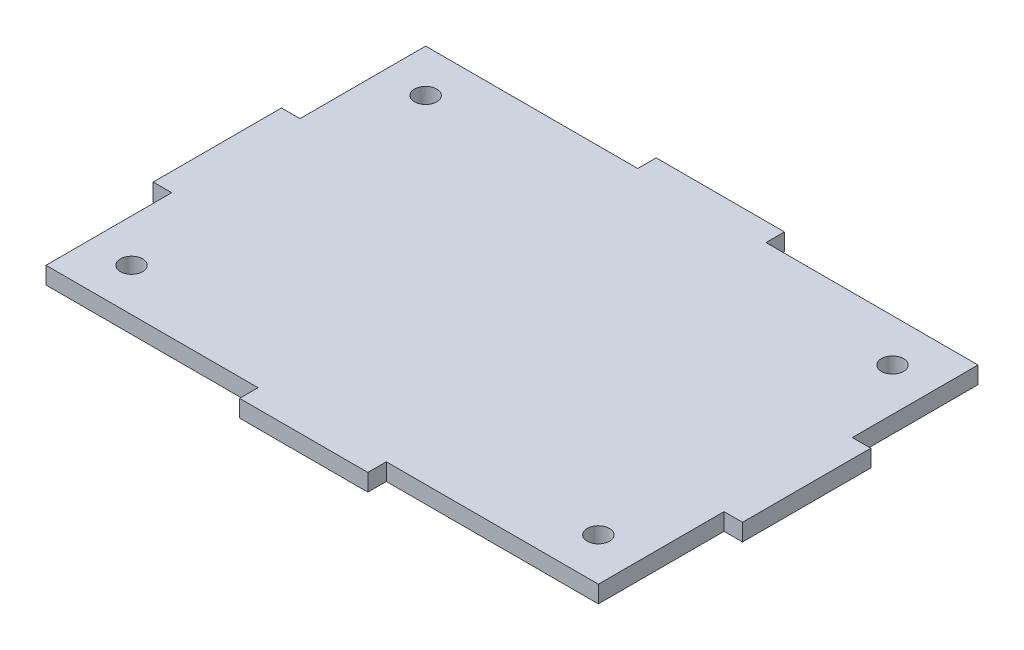
ISO-10303-21;
HEADER;
FILE_DESCRIPTION(('STEP AP214'),'2;1');
FILE_NAME('part.step','',(''),(''),'','','');
FILE_SCHEMA(('AUTOMOTIVE_DESIGN { 1 0 10303 214 1 1 1 1 }'));
ENDSEC;
DATA;
#1=APPLICATION_CONTEXT('core data for automotive mechanical design processes');
#2=APPLICATION_PROTOCOL_DEFINITION('international standard','automotive_design',2000,#1);
#3=PRODUCT_CONTEXT('',#1,'mechanical');
#4=PRODUCT('Part','Part','',(#3));
#5=PRODUCT_RELATED_PRODUCT_CATEGORY('part','',(#4));
#6=PRODUCT_DEFINITION_FORMATION('','',#4);
#7=PRODUCT_DEFINITION_CONTEXT('part definition',#1,'design');
#8=PRODUCT_DEFINITION('design','',#6,#7);
#9=PRODUCT_DEFINITION_SHAPE('','',#8);
#10=(LENGTH_UNIT() NAMED_UNIT(*) SI_UNIT(.MILLI.,.METRE.));
#11=(NAMED_UNIT(*) PLANE_ANGLE_UNIT() SI_UNIT($,.RADIAN.));
#12=(NAMED_UNIT(*) SI_UNIT($,.STERADIAN.) SOLID_ANGLE_UNIT());
#13=UNCERTAINTY_MEASURE_WITH_UNIT(LENGTH_MEASURE(1.E-05),#10,'distance_accuracy_value','');
#14=(GEOMETRIC_REPRESENTATION_CONTEXT(3) GLOBAL_UNCERTAINTY_ASSIGNED_CONTEXT((#13)) GLOBAL_UNIT_ASSIGNED_CONTEXT((#10,
#11,#12)) REPRESENTATION_CONTEXT('',''));
#15=CARTESIAN_POINT('',(0.,0.,0.));
#16=DIRECTION('',(0.,0.,1.));
#17=DIRECTION('',(1.,0.,0.));
#18=AXIS2_PLACEMENT_3D('',#15,#16,#17);
#19=CARTESIAN_POINT('',(-41.021,2.54,28.194));
#20=DIRECTION('',(1.,0.,0.));
#21=DIRECTION('',(0.,0.,-1.));
#22=AXIS2_PLACEMENT_3D('',#19,#20,#21);
#23=PLANE('',#22);
#24=DIRECTION('',(0.,1.,0.));
#25=VECTOR('',#24,1.);
#26=CARTESIAN_POINT('',(-41.021,-19.2464969862051,9.525));
#27=LINE('',#26,#25);
#28=CARTESIAN_POINT('',(-41.021,0.,9.52500000000001));
#29=VERTEX_POINT('',#28);
#30=CARTESIAN_POINT('',(-41.021,2.54,9.525));
#31=VERTEX_POINT('',#30);
#32=EDGE_CURVE('E56',#29,#31,#27,.T.);
#33=ORIENTED_EDGE('',*,*,#32,.F.);
#34=DIRECTION('',(0.,0.,1.));
#35=VECTOR('',#34,1.);
#36=CARTESIAN_POINT('',(-41.021,0.,28.194));
#37=LINE('',#36,#35);
#38=CARTESIAN_POINT('',(-41.021,0.,28.194));
#39=VERTEX_POINT('',#38);
#40=EDGE_CURVE('E303',#29,#39,#37,.T.);
#41=ORIENTED_EDGE('',*,*,#40,.T.);
#42=DIRECTION('',(0.,-1.,0.));
#43=VECTOR('',#42,1.);
#44=CARTESIAN_POINT('',(-41.021,2.54,28.194));
#45=LINE('',#44,#43);
#46=CARTESIAN_POINT('',(-41.021,2.54,28.194));
#47=VERTEX_POINT('',#46);
#48=EDGE_CURVE('E11',#47,#39,#45,.T.);
#49=ORIENTED_EDGE('',*,*,#48,.F.);
#50=DIRECTION('',(0.,0.,1.));
#51=VECTOR('',#50,1.);
#52=CARTESIAN_POINT('',(-41.021,2.54,28.194));
#53=LINE('',#52,#51);
#54=EDGE_CURVE('E308',#31,#47,#53,.T.);
#55=ORIENTED_EDGE('',*,*,#54,.F.);
#56=EDGE_LOOP('',(#33,#41,#49,#55));
#57=FACE_BOUND('',#56,.T.);
#58=ADVANCED_FACE('F33',(#57),#23,.F.);
#59=CARTESIAN_POINT('',(41.021,2.54,28.194));
#60=DIRECTION('',(-1.,0.,0.));
#61=DIRECTION('',(0.,0.,1.));
#62=AXIS2_PLACEMENT_3D('',#59,#60,#61);
#63=PLANE('',#62);
#64=DIRECTION('',(0.,1.,0.));
#65=VECTOR('',#64,1.);
#66=CARTESIAN_POINT('',(41.021,-19.2464969862051,-9.525));
#67=LINE('',#66,#65);
#68=CARTESIAN_POINT('',(41.021,0.,-9.52499999999998));
#69=VERTEX_POINT('',#68);
#70=CARTESIAN_POINT('',(41.021,2.54,-9.525));
#71=VERTEX_POINT('',#70);
#72=EDGE_CURVE('E210',#69,#71,#67,.T.);
#73=ORIENTED_EDGE('',*,*,#72,.F.);
#74=DIRECTION('',(0.,0.,-1.));
#75=VECTOR('',#74,1.);
#76=CARTESIAN_POINT('',(41.021,0.,28.194));
#77=LINE('',#76,#75);
#78=CARTESIAN_POINT('',(41.021,0.,-28.194));
#79=VERTEX_POINT('',#78);
#80=EDGE_CURVE('E326',#69,#79,#77,.T.);
#81=ORIENTED_EDGE('',*,*,#80,.T.);
#82=DIRECTION('',(0.,-1.,0.));
#83=VECTOR('',#82,1.);
#84=CARTESIAN_POINT('',(41.021,2.54,-28.194));
#85=LINE('',#84,#83);
#86=CARTESIAN_POINT('',(41.021,2.54,-28.194));
#87=VERTEX_POINT('',#86);
#88=EDGE_CURVE('E334',#87,#79,#85,.T.);
#89=ORIENTED_EDGE('',*,*,#88,.F.);
#90=DIRECTION('',(0.,0.,-1.));
#91=VECTOR('',#90,1.);
#92=CARTESIAN_POINT('',(41.021,2.54,28.194));
#93=LINE('',#92,#91);
#94=EDGE_CURVE('E312',#71,#87,#93,.T.);
#95=ORIENTED_EDGE('',*,*,#94,.F.);
#96=EDGE_LOOP('',(#73,#81,#89,#95));
#97=FACE_BOUND('',#96,.T.);
#98=ADVANCED_FACE('F405',(#97),#63,.F.);
#99=CARTESIAN_POINT('',(41.021,2.54,28.194));
#100=DIRECTION('',(0.,0.,-1.));
#101=DIRECTION('',(-1.,0.,0.));
#102=AXIS2_PLACEMENT_3D('',#99,#100,#101);
#103=PLANE('',#102);
#104=DIRECTION('',(0.,1.,0.));
#105=VECTOR('',#104,1.);
#106=CARTESIAN_POINT('',(9.52500000000001,-19.2464969862051,28.194));
#107=LINE('',#106,#105);
#108=CARTESIAN_POINT('',(9.52500000000001,0.,28.194));
#109=VERTEX_POINT('',#108);
#110=CARTESIAN_POINT('',(9.52500000000001,2.54,28.194));
#111=VERTEX_POINT('',#110);
#112=EDGE_CURVE('E249',#109,#111,#107,.T.);
#113=ORIENTED_EDGE('',*,*,#112,.F.);
#114=DIRECTION('',(1.,0.,0.));
#115=VECTOR('',#114,1.);
#116=CARTESIAN_POINT('',(41.021,0.,28.194));
#117=LINE('',#116,#115);
#118=CARTESIAN_POINT('',(41.021,0.,28.194));
#119=VERTEX_POINT('',#118);
#120=EDGE_CURVE('E323',#109,#119,#117,.T.);
#121=ORIENTED_EDGE('',*,*,#120,.T.);
#122=DIRECTION('',(0.,-1.,0.));
#123=VECTOR('',#122,1.);
#124=CARTESIAN_POINT('',(41.021,2.54,28.194));
#125=LINE('',#124,#123);
#126=CARTESIAN_POINT('',(41.021,2.54,28.194));
#127=VERTEX_POINT('',#126);
#128=EDGE_CURVE('E41',#127,#119,#125,.T.);
#129=ORIENTED_EDGE('',*,*,#128,.F.);
#130=DIRECTION('',(1.,0.,0.));
#131=VECTOR('',#130,1.);
#132=CARTESIAN_POINT('',(41.021,2.54,28.194));
#133=LINE('',#132,#131);
#134=EDGE_CURVE('E307',#111,#127,#133,.T.);
#135=ORIENTED_EDGE('',*,*,#134,.F.);
#136=EDGE_LOOP('',(#113,#121,#129,#135));
#137=FACE_BOUND('',#136,.T.);
#138=ADVANCED_FACE('F357',(#137),#103,.F.);
#139=CARTESIAN_POINT('',(41.021,2.54,-28.194));
#140=DIRECTION('',(0.,0.,1.));
#141=DIRECTION('',(1.,0.,0.));
#142=AXIS2_PLACEMENT_3D('',#139,#140,#141);
#143=PLANE('',#142);
#144=DIRECTION('',(0.,1.,0.));
#145=VECTOR('',#144,1.);
#146=CARTESIAN_POINT('',(-9.525,-19.2464969862051,-28.194));
#147=LINE('',#146,#145);
#148=CARTESIAN_POINT('',(-9.525,0.,-28.194));
#149=VERTEX_POINT('',#148);
#150=CARTESIAN_POINT('',(-9.525,2.54,-28.194));
#151=VERTEX_POINT('',#150);
#152=EDGE_CURVE('E274',#149,#151,#147,.T.);
#153=ORIENTED_EDGE('',*,*,#152,.F.);
#154=DIRECTION('',(-1.,0.,0.));
#155=VECTOR('',#154,1.);
#156=CARTESIAN_POINT('',(41.021,0.,-28.194));
#157=LINE('',#156,#155);
#158=CARTESIAN_POINT('',(-41.021,0.,-28.194));
#159=VERTEX_POINT('',#158);
#160=EDGE_CURVE('E329',#149,#159,#157,.T.);
#161=ORIENTED_EDGE('',*,*,#160,.T.);
#162=DIRECTION('',(0.,-1.,0.));
#163=VECTOR('',#162,1.);
#164=CARTESIAN_POINT('',(-41.021,2.54,-28.194));
#165=LINE('',#164,#163);
#166=CARTESIAN_POINT('',(-41.021,2.54,-28.194));
#167=VERTEX_POINT('',#166);
#168=EDGE_CURVE('E320',#167,#159,#165,.T.);
#169=ORIENTED_EDGE('',*,*,#168,.F.);
#170=DIRECTION('',(-1.,0.,0.));
#171=VECTOR('',#170,1.);
#172=CARTESIAN_POINT('',(41.021,2.54,-28.194));
#173=LINE('',#172,#171);
#174=EDGE_CURVE('E316',#151,#167,#173,.T.);
#175=ORIENTED_EDGE('',*,*,#174,.F.);
#176=EDGE_LOOP('',(#153,#161,#169,#175));
#177=FACE_BOUND('',#176,.T.);
#178=ADVANCED_FACE('F383',(#177),#143,.F.);
#179=CARTESIAN_POINT('',(0.,2.54,0.));
#180=DIRECTION('',(0.,1.,0.));
#181=DIRECTION('',(0.,0.,1.));
#182=AXIS2_PLACEMENT_3D('',#179,#180,#181);
#183=PLANE('',#182);
#184=CARTESIAN_POINT('',(34.671,2.54,21.844));
#185=DIRECTION('',(0.,1.,0.));
#186=DIRECTION('',(0.,0.,1.));
#187=AXIS2_PLACEMENT_3D('',#184,#185,#186);
#188=CIRCLE('',#187,1.651);
#189=CARTESIAN_POINT('',(34.671,2.54,23.495));
#190=VERTEX_POINT('',#189);
#191=EDGE_CURVE('E288',#190,#190,#188,.T.);
#192=ORIENTED_EDGE('',*,*,#191,.F.);
#193=EDGE_LOOP('',(#192));
#194=FACE_BOUND('',#193,.T.);
#195=CARTESIAN_POINT('',(-34.671,2.54,-21.844));
#196=DIRECTION('',(0.,1.,0.));
#197=DIRECTION('',(0.,0.,1.));
#198=AXIS2_PLACEMENT_3D('',#195,#196,#197);
#199=CIRCLE('',#198,1.651);
#200=CARTESIAN_POINT('',(-34.671,2.54,-20.193));
#201=VERTEX_POINT('',#200);
#202=EDGE_CURVE('E300',#201,#201,#199,.T.);
#203=ORIENTED_EDGE('',*,*,#202,.F.);
#204=EDGE_LOOP('',(#203));
#205=FACE_BOUND('',#204,.T.);
#206=CARTESIAN_POINT('',(-41.021,2.54,-9.52499999999999));
#207=VERTEX_POINT('',#206);
#208=EDGE_CURVE('E194',#167,#207,#53,.T.);
#209=ORIENTED_EDGE('',*,*,#208,.T.);
#210=DIRECTION('',(-1.,0.,0.));
#211=VECTOR('',#210,1.);
#212=CARTESIAN_POINT('',(-41.021,2.54,-9.525));
#213=LINE('',#212,#211);
#214=CARTESIAN_POINT('',(-43.7642,2.54,-9.525));
#215=VERTEX_POINT('',#214);
#216=EDGE_CURVE('E176',#207,#215,#213,.T.);
#217=ORIENTED_EDGE('',*,*,#216,.T.);
#218=DIRECTION('',(0.,0.,1.));
#219=VECTOR('',#218,1.);
#220=CARTESIAN_POINT('',(-43.7642,2.54,-9.525));
#221=LINE('',#220,#219);
#222=CARTESIAN_POINT('',(-43.7642,2.54,9.525));
#223=VERTEX_POINT('',#222);
#224=EDGE_CURVE('E184',#215,#223,#221,.T.);
#225=ORIENTED_EDGE('',*,*,#224,.T.);
#226=DIRECTION('',(1.,0.,0.));
#227=VECTOR('',#226,1.);
#228=CARTESIAN_POINT('',(-41.021,2.54,9.525));
#229=LINE('',#228,#227);
#230=EDGE_CURVE('E190',#223,#31,#229,.T.);
#231=ORIENTED_EDGE('',*,*,#230,.T.);
#232=ORIENTED_EDGE('',*,*,#54,.T.);
#233=CARTESIAN_POINT('',(-9.525,2.54,28.194));
#234=VERTEX_POINT('',#233);
#235=EDGE_CURVE('E309',#47,#234,#133,.T.);
#236=ORIENTED_EDGE('',*,*,#235,.T.);
#237=DIRECTION('',(0.,0.,1.));
#238=VECTOR('',#237,1.);
#239=CARTESIAN_POINT('',(-9.525,2.54,28.194));
#240=LINE('',#239,#238);
#241=CARTESIAN_POINT('',(-9.525,2.54,30.9372));
#242=VERTEX_POINT('',#241);
#243=EDGE_CURVE('E231',#234,#242,#240,.T.);
#244=ORIENTED_EDGE('',*,*,#243,.T.);
#245=DIRECTION('',(1.,0.,0.));
#246=VECTOR('',#245,1.);
#247=CARTESIAN_POINT('',(-9.525,2.54,30.9372));
#248=LINE('',#247,#246);
#249=CARTESIAN_POINT('',(9.525,2.54,30.9372));
#250=VERTEX_POINT('',#249);
#251=EDGE_CURVE('E241',#242,#250,#248,.T.);
#252=ORIENTED_EDGE('',*,*,#251,.T.);
#253=DIRECTION('',(0.,0.,-1.));
#254=VECTOR('',#253,1.);
#255=CARTESIAN_POINT('',(9.52500000000001,2.54,28.194));
#256=LINE('',#255,#254);
#257=EDGE_CURVE('E244',#250,#111,#256,.T.);
#258=ORIENTED_EDGE('',*,*,#257,.T.);
#259=ORIENTED_EDGE('',*,*,#134,.T.);
#260=CARTESIAN_POINT('',(41.021,2.54,9.52500000000001));
#261=VERTEX_POINT('',#260);
#262=EDGE_CURVE('E313',#127,#261,#93,.T.);
#263=ORIENTED_EDGE('',*,*,#262,.T.);
#264=DIRECTION('',(1.,0.,0.));
#265=VECTOR('',#264,1.);
#266=CARTESIAN_POINT('',(41.021,2.54,9.525));
#267=LINE('',#266,#265);
#268=CARTESIAN_POINT('',(43.7642,2.54,9.525));
#269=VERTEX_POINT('',#268);
#270=EDGE_CURVE('E206',#261,#269,#267,.T.);
#271=ORIENTED_EDGE('',*,*,#270,.T.);
#272=DIRECTION('',(0.,0.,-1.));
#273=VECTOR('',#272,1.);
#274=CARTESIAN_POINT('',(43.7642,2.54,-9.525));
#275=LINE('',#274,#273);
#276=CARTESIAN_POINT('',(43.7642,2.54,-9.525));
#277=VERTEX_POINT('',#276);
#278=EDGE_CURVE('E215',#269,#277,#275,.T.);
#279=ORIENTED_EDGE('',*,*,#278,.T.);
#280=DIRECTION('',(-1.,0.,0.));
#281=VECTOR('',#280,1.);
#282=CARTESIAN_POINT('',(41.021,2.54,-9.525));
#283=LINE('',#282,#281);
#284=EDGE_CURVE('E218',#277,#71,#283,.T.);
#285=ORIENTED_EDGE('',*,*,#284,.T.);
#286=ORIENTED_EDGE('',*,*,#94,.T.);
#287=CARTESIAN_POINT('',(9.525,2.54,-28.194));
#288=VERTEX_POINT('',#287);
#289=EDGE_CURVE('E317',#87,#288,#173,.T.);
#290=ORIENTED_EDGE('',*,*,#289,.T.);
#291=DIRECTION('',(0.,0.,-1.));
#292=VECTOR('',#291,1.);
#293=CARTESIAN_POINT('',(9.525,2.54,-28.194));
#294=LINE('',#293,#292);
#295=CARTESIAN_POINT('',(9.525,2.54,-30.9372));
#296=VERTEX_POINT('',#295);
#297=EDGE_CURVE('E256',#288,#296,#294,.T.);
#298=ORIENTED_EDGE('',*,*,#297,.T.);
#299=DIRECTION('',(-1.,0.,0.));
#300=VECTOR('',#299,1.);
#301=CARTESIAN_POINT('',(9.525,2.54,-30.9372));
#302=LINE('',#301,#300);
#303=CARTESIAN_POINT('',(-9.525,2.54,-30.9372));
#304=VERTEX_POINT('',#303);
#305=EDGE_CURVE('E266',#296,#304,#302,.T.);
#306=ORIENTED_EDGE('',*,*,#305,.T.);
#307=DIRECTION('',(0.,0.,1.));
#308=VECTOR('',#307,1.);
#309=CARTESIAN_POINT('',(-9.525,2.54,-28.194));
#310=LINE('',#309,#308);
#311=EDGE_CURVE('E269',#304,#151,#310,.T.);
#312=ORIENTED_EDGE('',*,*,#311,.T.);
#313=ORIENTED_EDGE('',*,*,#174,.T.);
#314=EDGE_LOOP('',(#209,#217,#225,#231,#232,#236,#244,#252,#258,#259,#263,#271,#279,#285,#286,
#290,#298,#306,#312,#313));
#315=FACE_BOUND('',#314,.T.);
#316=CARTESIAN_POINT('',(-34.671,2.54,21.844));
#317=DIRECTION('',(0.,1.,0.));
#318=DIRECTION('',(0.,0.,1.));
#319=AXIS2_PLACEMENT_3D('',#316,#317,#318);
#320=CIRCLE('',#319,1.651);
#321=CARTESIAN_POINT('',(-34.671,2.54,23.495));
#322=VERTEX_POINT('',#321);
#323=EDGE_CURVE('E294',#322,#322,#320,.T.);
#324=ORIENTED_EDGE('',*,*,#323,.F.);
#325=EDGE_LOOP('',(#324));
#326=FACE_BOUND('',#325,.T.);
#327=CARTESIAN_POINT('',(34.671,2.54,-21.844));
#328=DIRECTION('',(0.,1.,0.));
#329=DIRECTION('',(0.,0.,1.));
#330=AXIS2_PLACEMENT_3D('',#327,#328,#329);
#331=CIRCLE('',#330,1.651);
#332=CARTESIAN_POINT('',(34.671,2.54,-20.193));
#333=VERTEX_POINT('',#332);
#334=EDGE_CURVE('E282',#333,#333,#331,.T.);
#335=ORIENTED_EDGE('',*,*,#334,.F.);
#336=EDGE_LOOP('',(#335));
#337=FACE_BOUND('',#336,.T.);
#338=ADVANCED_FACE('F192',(#194,#205,#315,#326,#337),#183,.T.);
#339=CARTESIAN_POINT('',(0.,0.,0.));
#340=DIRECTION('',(0.,1.,0.));
#341=DIRECTION('',(0.,0.,1.));
#342=AXIS2_PLACEMENT_3D('',#339,#340,#341);
#343=PLANE('',#342);
#344=CARTESIAN_POINT('',(-41.021,0.,-9.52499999999999));
#345=VERTEX_POINT('',#344);
#346=EDGE_CURVE('E321',#159,#345,#37,.T.);
#347=ORIENTED_EDGE('',*,*,#346,.F.);
#348=ORIENTED_EDGE('',*,*,#160,.F.);
#349=DIRECTION('',(0.,0.,-1.));
#350=VECTOR('',#349,1.);
#351=CARTESIAN_POINT('',(-9.525,0.,-28.194));
#352=LINE('',#351,#350);
#353=CARTESIAN_POINT('',(-9.525,0.,-30.9372));
#354=VERTEX_POINT('',#353);
#355=EDGE_CURVE('E257',#149,#354,#352,.T.);
#356=ORIENTED_EDGE('',*,*,#355,.T.);
#357=DIRECTION('',(1.,0.,0.));
#358=VECTOR('',#357,1.);
#359=CARTESIAN_POINT('',(9.525,0.,-30.9372));
#360=LINE('',#359,#358);
#361=CARTESIAN_POINT('',(9.525,0.,-30.9372));
#362=VERTEX_POINT('',#361);
#363=EDGE_CURVE('E263',#354,#362,#360,.T.);
#364=ORIENTED_EDGE('',*,*,#363,.T.);
#365=DIRECTION('',(0.,0.,1.));
#366=VECTOR('',#365,1.);
#367=CARTESIAN_POINT('',(9.525,0.,-28.194));
#368=LINE('',#367,#366);
#369=CARTESIAN_POINT('',(9.525,0.,-28.194));
#370=VERTEX_POINT('',#369);
#371=EDGE_CURVE('E259',#362,#370,#368,.T.);
#372=ORIENTED_EDGE('',*,*,#371,.T.);
#373=EDGE_CURVE('E330',#79,#370,#157,.T.);
#374=ORIENTED_EDGE('',*,*,#373,.F.);
#375=ORIENTED_EDGE('',*,*,#80,.F.);
#376=DIRECTION('',(1.,0.,0.));
#377=VECTOR('',#376,1.);
#378=CARTESIAN_POINT('',(41.021,0.,-9.525));
#379=LINE('',#378,#377);
#380=CARTESIAN_POINT('',(43.7642,0.,-9.525));
#381=VERTEX_POINT('',#380);
#382=EDGE_CURVE('E209',#69,#381,#379,.T.);
#383=ORIENTED_EDGE('',*,*,#382,.T.);
#384=DIRECTION('',(0.,0.,1.));
#385=VECTOR('',#384,1.);
#386=CARTESIAN_POINT('',(43.7642,0.,-9.525));
#387=LINE('',#386,#385);
#388=CARTESIAN_POINT('',(43.7642,0.,9.525));
#389=VERTEX_POINT('',#388);
#390=EDGE_CURVE('E207',#381,#389,#387,.T.);
#391=ORIENTED_EDGE('',*,*,#390,.T.);
#392=DIRECTION('',(-1.,0.,0.));
#393=VECTOR('',#392,1.);
#394=CARTESIAN_POINT('',(41.021,0.,9.525));
#395=LINE('',#394,#393);
#396=CARTESIAN_POINT('',(41.021,0.,9.52500000000001));
#397=VERTEX_POINT('',#396);
#398=EDGE_CURVE('E212',#389,#397,#395,.T.);
#399=ORIENTED_EDGE('',*,*,#398,.T.);
#400=EDGE_CURVE('E327',#119,#397,#77,.T.);
#401=ORIENTED_EDGE('',*,*,#400,.F.);
#402=ORIENTED_EDGE('',*,*,#120,.F.);
#403=DIRECTION('',(0.,0.,1.));
#404=VECTOR('',#403,1.);
#405=CARTESIAN_POINT('',(9.52500000000001,0.,28.194));
#406=LINE('',#405,#404);
#407=CARTESIAN_POINT('',(9.525,0.,30.9372));
#408=VERTEX_POINT('',#407);
#409=EDGE_CURVE('E232',#109,#408,#406,.T.);
#410=ORIENTED_EDGE('',*,*,#409,.T.);
#411=DIRECTION('',(-1.,0.,0.));
#412=VECTOR('',#411,1.);
#413=CARTESIAN_POINT('',(-9.525,0.,30.9372));
#414=LINE('',#413,#412);
#415=CARTESIAN_POINT('',(-9.525,0.,30.9372));
#416=VERTEX_POINT('',#415);
#417=EDGE_CURVE('E238',#408,#416,#414,.T.);
#418=ORIENTED_EDGE('',*,*,#417,.T.);
#419=DIRECTION('',(0.,0.,-1.));
#420=VECTOR('',#419,1.);
#421=CARTESIAN_POINT('',(-9.525,0.,28.194));
#422=LINE('',#421,#420);
#423=CARTESIAN_POINT('',(-9.525,0.,28.194));
#424=VERTEX_POINT('',#423);
#425=EDGE_CURVE('E234',#416,#424,#422,.T.);
#426=ORIENTED_EDGE('',*,*,#425,.T.);
#427=EDGE_CURVE('E324',#39,#424,#117,.T.);
#428=ORIENTED_EDGE('',*,*,#427,.F.);
#429=ORIENTED_EDGE('',*,*,#40,.F.);
#430=DIRECTION('',(-1.,0.,0.));
#431=VECTOR('',#430,1.);
#432=CARTESIAN_POINT('',(-41.021,0.,9.525));
#433=LINE('',#432,#431);
#434=CARTESIAN_POINT('',(-43.7642,0.,9.525));
#435=VERTEX_POINT('',#434);
#436=EDGE_CURVE('E197',#29,#435,#433,.T.);
#437=ORIENTED_EDGE('',*,*,#436,.T.);
#438=DIRECTION('',(0.,0.,-1.));
#439=VECTOR('',#438,1.);
#440=CARTESIAN_POINT('',(-43.7642,0.,-9.525));
#441=LINE('',#440,#439);
#442=CARTESIAN_POINT('',(-43.7642,0.,-9.525));
#443=VERTEX_POINT('',#442);
#444=EDGE_CURVE('E202',#435,#443,#441,.T.);
#445=ORIENTED_EDGE('',*,*,#444,.T.);
#446=DIRECTION('',(1.,0.,0.));
#447=VECTOR('',#446,1.);
#448=CARTESIAN_POINT('',(-41.021,0.,-9.525));
#449=LINE('',#448,#447);
#450=EDGE_CURVE('E178',#443,#345,#449,.T.);
#451=ORIENTED_EDGE('',*,*,#450,.T.);
#452=EDGE_LOOP('',(#347,#348,#356,#364,#372,#374,#375,#383,#391,#399,#401,#402,#410,#418,#426,
#428,#429,#437,#445,#451));
#453=FACE_BOUND('',#452,.T.);
#454=CARTESIAN_POINT('',(-34.671,0.,-21.844));
#455=DIRECTION('',(0.,1.,0.));
#456=DIRECTION('',(0.,0.,1.));
#457=AXIS2_PLACEMENT_3D('',#454,#455,#456);
#458=CIRCLE('',#457,1.651);
#459=CARTESIAN_POINT('',(-34.671,0.,-20.193));
#460=VERTEX_POINT('',#459);
#461=EDGE_CURVE('E297',#460,#460,#458,.T.);
#462=ORIENTED_EDGE('',*,*,#461,.T.);
#463=EDGE_LOOP('',(#462));
#464=FACE_BOUND('',#463,.T.);
#465=CARTESIAN_POINT('',(-34.671,0.,21.844));
#466=DIRECTION('',(0.,1.,0.));
#467=DIRECTION('',(0.,0.,1.));
#468=AXIS2_PLACEMENT_3D('',#465,#466,#467);
#469=CIRCLE('',#468,1.651);
#470=CARTESIAN_POINT('',(-34.671,0.,23.495));
#471=VERTEX_POINT('',#470);
#472=EDGE_CURVE('E291',#471,#471,#469,.T.);
#473=ORIENTED_EDGE('',*,*,#472,.T.);
#474=EDGE_LOOP('',(#473));
#475=FACE_BOUND('',#474,.T.);
#476=CARTESIAN_POINT('',(34.671,0.,21.844));
#477=DIRECTION('',(0.,1.,0.));
#478=DIRECTION('',(0.,0.,1.));
#479=AXIS2_PLACEMENT_3D('',#476,#477,#478);
#480=CIRCLE('',#479,1.651);
#481=CARTESIAN_POINT('',(34.671,0.,23.495));
#482=VERTEX_POINT('',#481);
#483=EDGE_CURVE('E285',#482,#482,#480,.T.);
#484=ORIENTED_EDGE('',*,*,#483,.T.);
#485=EDGE_LOOP('',(#484));
#486=FACE_BOUND('',#485,.T.);
#487=CARTESIAN_POINT('',(34.671,0.,-21.844));
#488=DIRECTION('',(0.,1.,0.));
#489=DIRECTION('',(0.,0.,1.));
#490=AXIS2_PLACEMENT_3D('',#487,#488,#489);
#491=CIRCLE('',#490,1.651);
#492=CARTESIAN_POINT('',(34.671,0.,-20.193));
#493=VERTEX_POINT('',#492);
#494=EDGE_CURVE('E281',#493,#493,#491,.T.);
#495=ORIENTED_EDGE('',*,*,#494,.T.);
#496=EDGE_LOOP('',(#495));
#497=FACE_BOUND('',#496,.T.);
#498=ADVANCED_FACE('F346',(#453,#464,#475,#486,#497),#343,.F.);
#499=ORIENTED_EDGE('',*,*,#346,.T.);
#500=DIRECTION('',(0.,1.,0.));
#501=VECTOR('',#500,1.);
#502=CARTESIAN_POINT('',(-41.021,-19.2464969862051,-9.525));
#503=LINE('',#502,#501);
#504=EDGE_CURVE('E48',#345,#207,#503,.T.);
#505=ORIENTED_EDGE('',*,*,#504,.T.);
#506=ORIENTED_EDGE('',*,*,#208,.F.);
#507=ORIENTED_EDGE('',*,*,#168,.T.);
#508=EDGE_LOOP('',(#499,#505,#506,#507));
#509=FACE_BOUND('',#508,.T.);
#510=ADVANCED_FACE('F35',(#509),#23,.F.);
#511=ORIENTED_EDGE('',*,*,#427,.T.);
#512=DIRECTION('',(0.,1.,0.));
#513=VECTOR('',#512,1.);
#514=CARTESIAN_POINT('',(-9.525,-19.2464969862051,28.194));
#515=LINE('',#514,#513);
#516=EDGE_CURVE('E235',#424,#234,#515,.T.);
#517=ORIENTED_EDGE('',*,*,#516,.T.);
#518=ORIENTED_EDGE('',*,*,#235,.F.);
#519=ORIENTED_EDGE('',*,*,#48,.T.);
#520=EDGE_LOOP('',(#511,#517,#518,#519));
#521=FACE_BOUND('',#520,.T.);
#522=ADVANCED_FACE('F375',(#521),#103,.F.);
#523=ORIENTED_EDGE('',*,*,#400,.T.);
#524=DIRECTION('',(0.,1.,0.));
#525=VECTOR('',#524,1.);
#526=CARTESIAN_POINT('',(41.021,-19.2464969862051,9.525));
#527=LINE('',#526,#525);
#528=EDGE_CURVE('E221',#397,#261,#527,.T.);
#529=ORIENTED_EDGE('',*,*,#528,.T.);
#530=ORIENTED_EDGE('',*,*,#262,.F.);
#531=ORIENTED_EDGE('',*,*,#128,.T.);
#532=EDGE_LOOP('',(#523,#529,#530,#531));
#533=FACE_BOUND('',#532,.T.);
#534=ADVANCED_FACE('F341',(#533),#63,.F.);
#535=ORIENTED_EDGE('',*,*,#373,.T.);
#536=DIRECTION('',(0.,1.,0.));
#537=VECTOR('',#536,1.);
#538=CARTESIAN_POINT('',(9.525,-19.2464969862051,-28.194));
#539=LINE('',#538,#537);
#540=EDGE_CURVE('E260',#370,#288,#539,.T.);
#541=ORIENTED_EDGE('',*,*,#540,.T.);
#542=ORIENTED_EDGE('',*,*,#289,.F.);
#543=ORIENTED_EDGE('',*,*,#88,.T.);
#544=EDGE_LOOP('',(#535,#541,#542,#543));
#545=FACE_BOUND('',#544,.T.);
#546=ADVANCED_FACE('F401',(#545),#143,.F.);
#547=CARTESIAN_POINT('',(-34.671,2.54,-21.844));
#548=DIRECTION('',(0.,-1.,0.));
#549=DIRECTION('',(0.,0.,-1.));
#550=AXIS2_PLACEMENT_3D('',#547,#548,#549);
#551=CYLINDRICAL_SURFACE('',#550,1.651);
#552=ORIENTED_EDGE('',*,*,#202,.T.);
#553=EDGE_LOOP('',(#552));
#554=FACE_BOUND('',#553,.T.);
#555=ORIENTED_EDGE('',*,*,#461,.F.);
#556=EDGE_LOOP('',(#555));
#557=FACE_BOUND('',#556,.T.);
#558=ADVANCED_FACE('F441',(#554,#557),#551,.F.);
#559=CARTESIAN_POINT('',(-34.671,2.54,21.844));
#560=DIRECTION('',(0.,-1.,0.));
#561=DIRECTION('',(0.,0.,-1.));
#562=AXIS2_PLACEMENT_3D('',#559,#560,#561);
#563=CYLINDRICAL_SURFACE('',#562,1.651);
#564=ORIENTED_EDGE('',*,*,#323,.T.);
#565=EDGE_LOOP('',(#564));
#566=FACE_BOUND('',#565,.T.);
#567=ORIENTED_EDGE('',*,*,#472,.F.);
#568=EDGE_LOOP('',(#567));
#569=FACE_BOUND('',#568,.T.);
#570=ADVANCED_FACE('F458',(#566,#569),#563,.F.);
#571=CARTESIAN_POINT('',(34.671,2.54,21.844));
#572=DIRECTION('',(0.,-1.,0.));
#573=DIRECTION('',(0.,0.,-1.));
#574=AXIS2_PLACEMENT_3D('',#571,#572,#573);
#575=CYLINDRICAL_SURFACE('',#574,1.651);
#576=ORIENTED_EDGE('',*,*,#191,.T.);
#577=EDGE_LOOP('',(#576));
#578=FACE_BOUND('',#577,.T.);
#579=ORIENTED_EDGE('',*,*,#483,.F.);
#580=EDGE_LOOP('',(#579));
#581=FACE_BOUND('',#580,.T.);
#582=ADVANCED_FACE('F465',(#578,#581),#575,.F.);
#583=CARTESIAN_POINT('',(34.671,2.54,-21.844));
#584=DIRECTION('',(0.,-1.,0.));
#585=DIRECTION('',(0.,0.,-1.));
#586=AXIS2_PLACEMENT_3D('',#583,#584,#585);
#587=CYLINDRICAL_SURFACE('',#586,1.651);
#588=ORIENTED_EDGE('',*,*,#334,.T.);
#589=EDGE_LOOP('',(#588));
#590=FACE_BOUND('',#589,.T.);
#591=ORIENTED_EDGE('',*,*,#494,.F.);
#592=EDGE_LOOP('',(#591));
#593=FACE_BOUND('',#592,.T.);
#594=ADVANCED_FACE('F473',(#590,#593),#587,.F.);
#595=CARTESIAN_POINT('',(9.525,-19.2464969862051,-28.194));
#596=DIRECTION('',(1.,0.,0.));
#597=DIRECTION('',(0.,0.,-1.));
#598=AXIS2_PLACEMENT_3D('',#595,#596,#597);
#599=PLANE('',#598);
#600=ORIENTED_EDGE('',*,*,#371,.F.);
#601=DIRECTION('',(0.,1.,0.));
#602=VECTOR('',#601,1.);
#603=CARTESIAN_POINT('',(9.525,-19.2464969862051,-30.9372));
#604=LINE('',#603,#602);
#605=EDGE_CURVE('E272',#362,#296,#604,.T.);
#606=ORIENTED_EDGE('',*,*,#605,.T.);
#607=ORIENTED_EDGE('',*,*,#297,.F.);
#608=ORIENTED_EDGE('',*,*,#540,.F.);
#609=EDGE_LOOP('',(#600,#606,#607,#608));
#610=FACE_BOUND('',#609,.T.);
#611=ADVANCED_FACE('F398',(#610),#599,.T.);
#612=CARTESIAN_POINT('',(-9.525,-19.2464969862051,-28.194));
#613=DIRECTION('',(-1.,0.,0.));
#614=DIRECTION('',(0.,0.,1.));
#615=AXIS2_PLACEMENT_3D('',#612,#613,#614);
#616=PLANE('',#615);
#617=ORIENTED_EDGE('',*,*,#355,.F.);
#618=ORIENTED_EDGE('',*,*,#152,.T.);
#619=ORIENTED_EDGE('',*,*,#311,.F.);
#620=DIRECTION('',(0.,1.,0.));
#621=VECTOR('',#620,1.);
#622=CARTESIAN_POINT('',(-9.525,-19.2464969862051,-30.9372));
#623=LINE('',#622,#621);
#624=EDGE_CURVE('E277',#354,#304,#623,.T.);
#625=ORIENTED_EDGE('',*,*,#624,.F.);
#626=EDGE_LOOP('',(#617,#618,#619,#625));
#627=FACE_BOUND('',#626,.T.);
#628=ADVANCED_FACE('F386',(#627),#616,.T.);
#629=CARTESIAN_POINT('',(9.525,-19.2464969862051,-30.9372));
#630=DIRECTION('',(0.,0.,-1.));
#631=DIRECTION('',(-1.,0.,0.));
#632=AXIS2_PLACEMENT_3D('',#629,#630,#631);
#633=PLANE('',#632);
#634=ORIENTED_EDGE('',*,*,#363,.F.);
#635=ORIENTED_EDGE('',*,*,#624,.T.);
#636=ORIENTED_EDGE('',*,*,#305,.F.);
#637=ORIENTED_EDGE('',*,*,#605,.F.);
#638=EDGE_LOOP('',(#634,#635,#636,#637));
#639=FACE_BOUND('',#638,.T.);
#640=ADVANCED_FACE('F393',(#639),#633,.T.);
#641=CARTESIAN_POINT('',(-9.525,-19.2464969862051,28.194));
#642=DIRECTION('',(-1.,0.,0.));
#643=DIRECTION('',(0.,0.,1.));
#644=AXIS2_PLACEMENT_3D('',#641,#642,#643);
#645=PLANE('',#644);
#646=ORIENTED_EDGE('',*,*,#425,.F.);
#647=DIRECTION('',(0.,1.,0.));
#648=VECTOR('',#647,1.);
#649=CARTESIAN_POINT('',(-9.525,-19.2464969862051,30.9372));
#650=LINE('',#649,#648);
#651=EDGE_CURVE('E247',#416,#242,#650,.T.);
#652=ORIENTED_EDGE('',*,*,#651,.T.);
#653=ORIENTED_EDGE('',*,*,#243,.F.);
#654=ORIENTED_EDGE('',*,*,#516,.F.);
#655=EDGE_LOOP('',(#646,#652,#653,#654));
#656=FACE_BOUND('',#655,.T.);
#657=ADVANCED_FACE('F368',(#656),#645,.T.);
#658=CARTESIAN_POINT('',(9.52500000000001,-19.2464969862051,28.194));
#659=DIRECTION('',(1.,0.,0.));
#660=DIRECTION('',(0.,0.,-1.));
#661=AXIS2_PLACEMENT_3D('',#658,#659,#660);
#662=PLANE('',#661);
#663=ORIENTED_EDGE('',*,*,#409,.F.);
#664=ORIENTED_EDGE('',*,*,#112,.T.);
#665=ORIENTED_EDGE('',*,*,#257,.F.);
#666=DIRECTION('',(0.,1.,0.));
#667=VECTOR('',#666,1.);
#668=CARTESIAN_POINT('',(9.525,-19.2464969862051,30.9372));
#669=LINE('',#668,#667);
#670=EDGE_CURVE('E252',#408,#250,#669,.T.);
#671=ORIENTED_EDGE('',*,*,#670,.F.);
#672=EDGE_LOOP('',(#663,#664,#665,#671));
#673=FACE_BOUND('',#672,.T.);
#674=ADVANCED_FACE('F359',(#673),#662,.T.);
#675=CARTESIAN_POINT('',(-9.525,-19.2464969862051,30.9372));
#676=DIRECTION('',(0.,0.,1.));
#677=DIRECTION('',(1.,0.,0.));
#678=AXIS2_PLACEMENT_3D('',#675,#676,#677);
#679=PLANE('',#678);
#680=ORIENTED_EDGE('',*,*,#417,.F.);
#681=ORIENTED_EDGE('',*,*,#670,.T.);
#682=ORIENTED_EDGE('',*,*,#251,.F.);
#683=ORIENTED_EDGE('',*,*,#651,.F.);
#684=EDGE_LOOP('',(#680,#681,#682,#683));
#685=FACE_BOUND('',#684,.T.);
#686=ADVANCED_FACE('F371',(#685),#679,.T.);
#687=CARTESIAN_POINT('',(41.021,-19.2464969862051,-9.525));
#688=DIRECTION('',(0.,0.,-1.));
#689=DIRECTION('',(-1.,0.,0.));
#690=AXIS2_PLACEMENT_3D('',#687,#688,#689);
#691=PLANE('',#690);
#692=ORIENTED_EDGE('',*,*,#382,.F.);
#693=ORIENTED_EDGE('',*,*,#72,.T.);
#694=ORIENTED_EDGE('',*,*,#284,.F.);
#695=DIRECTION('',(0.,1.,0.));
#696=VECTOR('',#695,1.);
#697=CARTESIAN_POINT('',(43.7642,-19.2464969862051,-9.525));
#698=LINE('',#697,#696);
#699=EDGE_CURVE('E224',#381,#277,#698,.T.);
#700=ORIENTED_EDGE('',*,*,#699,.F.);
#701=EDGE_LOOP('',(#692,#693,#694,#700));
#702=FACE_BOUND('',#701,.T.);
#703=ADVANCED_FACE('F410',(#702),#691,.T.);
#704=CARTESIAN_POINT('',(43.7642,-19.2464969862051,-9.525));
#705=DIRECTION('',(1.,0.,0.));
#706=DIRECTION('',(0.,0.,-1.));
#707=AXIS2_PLACEMENT_3D('',#704,#705,#706);
#708=PLANE('',#707);
#709=ORIENTED_EDGE('',*,*,#390,.F.);
#710=ORIENTED_EDGE('',*,*,#699,.T.);
#711=ORIENTED_EDGE('',*,*,#278,.F.);
#712=DIRECTION('',(0.,1.,0.));
#713=VECTOR('',#712,1.);
#714=CARTESIAN_POINT('',(43.7642,-19.2464969862051,9.525));
#715=LINE('',#714,#713);
#716=EDGE_CURVE('E226',#389,#269,#715,.T.);
#717=ORIENTED_EDGE('',*,*,#716,.F.);
#718=EDGE_LOOP('',(#709,#710,#711,#717));
#719=FACE_BOUND('',#718,.T.);
#720=ADVANCED_FACE('F413',(#719),#708,.T.);
#721=CARTESIAN_POINT('',(41.021,-19.2464969862051,9.525));
#722=DIRECTION('',(0.,0.,1.));
#723=DIRECTION('',(1.,0.,0.));
#724=AXIS2_PLACEMENT_3D('',#721,#722,#723);
#725=PLANE('',#724);
#726=ORIENTED_EDGE('',*,*,#398,.F.);
#727=ORIENTED_EDGE('',*,*,#716,.T.);
#728=ORIENTED_EDGE('',*,*,#270,.F.);
#729=ORIENTED_EDGE('',*,*,#528,.F.);
#730=EDGE_LOOP('',(#726,#727,#728,#729));
#731=FACE_BOUND('',#730,.T.);
#732=ADVANCED_FACE('F355',(#731),#725,.T.);
#733=CARTESIAN_POINT('',(-41.021,-19.2464969862051,9.525));
#734=DIRECTION('',(0.,0.,1.));
#735=DIRECTION('',(1.,0.,0.));
#736=AXIS2_PLACEMENT_3D('',#733,#734,#735);
#737=PLANE('',#736);
#738=ORIENTED_EDGE('',*,*,#436,.F.);
#739=ORIENTED_EDGE('',*,*,#32,.T.);
#740=ORIENTED_EDGE('',*,*,#230,.F.);
#741=DIRECTION('',(0.,1.,0.));
#742=VECTOR('',#741,1.);
#743=CARTESIAN_POINT('',(-43.7642,-19.2464969862051,9.525));
#744=LINE('',#743,#742);
#745=EDGE_CURVE('E181',#435,#223,#744,.T.);
#746=ORIENTED_EDGE('',*,*,#745,.F.);
#747=EDGE_LOOP('',(#738,#739,#740,#746));
#748=FACE_BOUND('',#747,.T.);
#749=ADVANCED_FACE('F378',(#748),#737,.T.);
#750=CARTESIAN_POINT('',(-43.7642,-19.2464969862051,-9.525));
#751=DIRECTION('',(-1.,0.,0.));
#752=DIRECTION('',(0.,0.,1.));
#753=AXIS2_PLACEMENT_3D('',#750,#751,#752);
#754=PLANE('',#753);
#755=ORIENTED_EDGE('',*,*,#444,.F.);
#756=ORIENTED_EDGE('',*,*,#745,.T.);
#757=ORIENTED_EDGE('',*,*,#224,.F.);
#758=DIRECTION('',(0.,1.,0.));
#759=VECTOR('',#758,1.);
#760=CARTESIAN_POINT('',(-43.7642,-19.2464969862051,-9.525));
#761=LINE('',#760,#759);
#762=EDGE_CURVE('E172',#443,#215,#761,.T.);
#763=ORIENTED_EDGE('',*,*,#762,.F.);
#764=EDGE_LOOP('',(#755,#756,#757,#763));
#765=FACE_BOUND('',#764,.T.);
#766=ADVANCED_FACE('F185',(#765),#754,.T.);
#767=CARTESIAN_POINT('',(-41.021,-19.2464969862051,-9.525));
#768=DIRECTION('',(0.,0.,-1.));
#769=DIRECTION('',(-1.,0.,0.));
#770=AXIS2_PLACEMENT_3D('',#767,#768,#769);
#771=PLANE('',#770);
#772=ORIENTED_EDGE('',*,*,#450,.F.);
#773=ORIENTED_EDGE('',*,*,#762,.T.);
#774=ORIENTED_EDGE('',*,*,#216,.F.);
#775=ORIENTED_EDGE('',*,*,#504,.F.);
#776=EDGE_LOOP('',(#772,#773,#774,#775));
#777=FACE_BOUND('',#776,.T.);
#778=ADVANCED_FACE('F174',(#777),#771,.T.);
#779=CLOSED_SHELL('',(#58,#98,#138,#178,#338,#498,#510,#522,#534,#546,#558,#570,#582,#594,#611,
#628,#640,#657,#674,#686,#703,#720,#732,#749,#766,#778));
#780=MANIFOLD_SOLID_BREP('B2',#779);
#781=ADVANCED_BREP_SHAPE_REPRESENTATION('',(#18,#780),#14);
#782=SHAPE_DEFINITION_REPRESENTATION(#9,#781);
ENDSEC;
END-ISO-10303-21;
